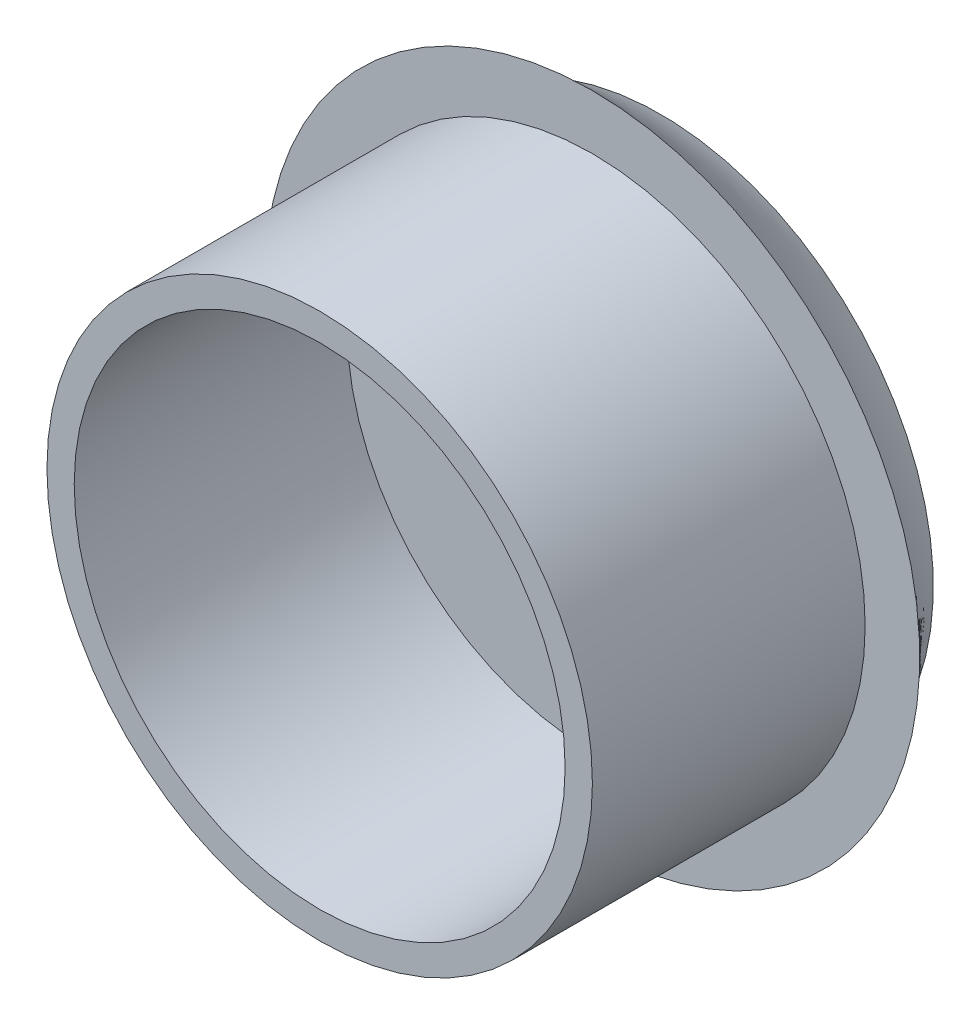
ISO-10303-21;
HEADER;
FILE_DESCRIPTION(('STEP AP214'),'2;1');
FILE_NAME('part.step','',(''),(''),'','','');
FILE_SCHEMA(('AUTOMOTIVE_DESIGN { 1 0 10303 214 1 1 1 1 }'));
ENDSEC;
DATA;
#1=APPLICATION_CONTEXT('core data for automotive mechanical design processes');
#2=APPLICATION_PROTOCOL_DEFINITION('international standard','automotive_design',2000,#1);
#3=PRODUCT_CONTEXT('',#1,'mechanical');
#4=PRODUCT('Part','Part','',(#3));
#5=PRODUCT_RELATED_PRODUCT_CATEGORY('part','',(#4));
#6=PRODUCT_DEFINITION_FORMATION('','',#4);
#7=PRODUCT_DEFINITION_CONTEXT('part definition',#1,'design');
#8=PRODUCT_DEFINITION('design','',#6,#7);
#9=PRODUCT_DEFINITION_SHAPE('','',#8);
#10=(LENGTH_UNIT() NAMED_UNIT(*) SI_UNIT(.MILLI.,.METRE.));
#11=(NAMED_UNIT(*) PLANE_ANGLE_UNIT() SI_UNIT($,.RADIAN.));
#12=(NAMED_UNIT(*) SI_UNIT($,.STERADIAN.) SOLID_ANGLE_UNIT());
#13=UNCERTAINTY_MEASURE_WITH_UNIT(LENGTH_MEASURE(1.E-05),#10,'distance_accuracy_value','');
#14=(GEOMETRIC_REPRESENTATION_CONTEXT(3) GLOBAL_UNCERTAINTY_ASSIGNED_CONTEXT((#13)) GLOBAL_UNIT_ASSIGNED_CONTEXT((#10,
#11,#12)) REPRESENTATION_CONTEXT('',''));
#15=CARTESIAN_POINT('',(0.,0.,0.));
#16=DIRECTION('',(0.,0.,1.));
#17=DIRECTION('',(1.,0.,0.));
#18=AXIS2_PLACEMENT_3D('',#15,#16,#17);
#19=CARTESIAN_POINT('',(0.,0.,10.));
#20=DIRECTION('',(0.,0.,1.));
#21=DIRECTION('',(1.,0.,0.));
#22=AXIS2_PLACEMENT_3D('',#19,#20,#21);
#23=PLANE('',#22);
#24=CARTESIAN_POINT('',(0.,0.,10.));
#25=DIRECTION('',(0.,0.,1.));
#26=DIRECTION('',(1.,0.,0.));
#27=AXIS2_PLACEMENT_3D('',#24,#25,#26);
#28=CIRCLE('',#27,10.);
#29=CARTESIAN_POINT('',(10.,0.,10.));
#30=VERTEX_POINT('',#29);
#31=EDGE_CURVE('E11',#30,#30,#28,.T.);
#32=ORIENTED_EDGE('',*,*,#31,.T.);
#33=EDGE_LOOP('',(#32));
#34=FACE_BOUND('',#33,.T.);
#35=CARTESIAN_POINT('',(0.,0.,10.));
#36=DIRECTION('',(0.,0.,1.));
#37=DIRECTION('',(1.,0.,0.));
#38=AXIS2_PLACEMENT_3D('',#35,#36,#37);
#39=CIRCLE('',#38,9.);
#40=CARTESIAN_POINT('',(9.,0.,10.));
#41=VERTEX_POINT('',#40);
#42=EDGE_CURVE('E43',#41,#41,#39,.T.);
#43=ORIENTED_EDGE('',*,*,#42,.F.);
#44=EDGE_LOOP('',(#43));
#45=FACE_BOUND('',#44,.T.);
#46=ADVANCED_FACE('F35',(#34,#45),#23,.T.);
#47=CARTESIAN_POINT('',(0.,0.,10.));
#48=DIRECTION('',(0.,0.,-1.));
#49=DIRECTION('',(-1.,0.,0.));
#50=AXIS2_PLACEMENT_3D('',#47,#48,#49);
#51=CYLINDRICAL_SURFACE('',#50,10.);
#52=ORIENTED_EDGE('',*,*,#31,.F.);
#53=EDGE_LOOP('',(#52));
#54=FACE_BOUND('',#53,.T.);
#55=CARTESIAN_POINT('',(0.,0.,0.));
#56=DIRECTION('',(0.,0.,1.));
#57=DIRECTION('',(1.,0.,0.));
#58=AXIS2_PLACEMENT_3D('',#55,#56,#57);
#59=CIRCLE('',#58,10.);
#60=CARTESIAN_POINT('',(10.,0.,0.));
#61=VERTEX_POINT('',#60);
#62=EDGE_CURVE('E39',#61,#61,#59,.T.);
#63=ORIENTED_EDGE('',*,*,#62,.T.);
#64=EDGE_LOOP('',(#63));
#65=FACE_BOUND('',#64,.T.);
#66=ADVANCED_FACE('F37',(#54,#65),#51,.T.);
#67=CARTESIAN_POINT('',(0.,0.,10.));
#68=DIRECTION('',(0.,0.,-1.));
#69=DIRECTION('',(-1.,0.,0.));
#70=AXIS2_PLACEMENT_3D('',#67,#68,#69);
#71=CYLINDRICAL_SURFACE('',#70,9.);
#72=ORIENTED_EDGE('',*,*,#42,.T.);
#73=EDGE_LOOP('',(#72));
#74=FACE_BOUND('',#73,.T.);
#75=CARTESIAN_POINT('',(0.,0.,0.));
#76=DIRECTION('',(0.,0.,1.));
#77=DIRECTION('',(1.,0.,0.));
#78=AXIS2_PLACEMENT_3D('',#75,#76,#77);
#79=CIRCLE('',#78,9.);
#80=CARTESIAN_POINT('',(9.,0.,0.));
#81=VERTEX_POINT('',#80);
#82=EDGE_CURVE('E47',#81,#81,#79,.T.);
#83=ORIENTED_EDGE('',*,*,#82,.F.);
#84=EDGE_LOOP('',(#83));
#85=FACE_BOUND('',#84,.T.);
#86=ADVANCED_FACE('F81',(#74,#85),#71,.F.);
#87=CARTESIAN_POINT('',(0.,0.,0.));
#88=DIRECTION('',(0.,0.,-1.));
#89=DIRECTION('',(-1.,0.,0.));
#90=AXIS2_PLACEMENT_3D('',#87,#88,#89);
#91=PLANE('',#90);
#92=ORIENTED_EDGE('',*,*,#82,.T.);
#93=EDGE_LOOP('',(#92));
#94=FACE_BOUND('',#93,.T.);
#95=ADVANCED_FACE('F74',(#94),#91,.F.);
#96=CARTESIAN_POINT('',(0.,0.,-2.5));
#97=DIRECTION('',(0.,0.,-1.));
#98=DIRECTION('',(-1.,0.,0.));
#99=AXIS2_PLACEMENT_3D('',#96,#97,#98);
#100=PLANE('',#99);
#101=CARTESIAN_POINT('',(0.,0.,-2.5));
#102=DIRECTION('',(0.,0.,-1.));
#103=DIRECTION('',(-1.,0.,0.));
#104=AXIS2_PLACEMENT_3D('',#101,#102,#103);
#105=CIRCLE('',#104,10.);
#106=CARTESIAN_POINT('',(-1.50225589120757,9.88651744737914,-2.5));
#107=VERTEX_POINT('',#106);
#108=EDGE_CURVE('E54',#107,#107,#105,.T.);
#109=ORIENTED_EDGE('',*,*,#108,.T.);
#110=EDGE_LOOP('',(#109));
#111=FACE_BOUND('',#110,.T.);
#112=ADVANCED_FACE('F63',(#111),#100,.T.);
#113=ORIENTED_EDGE('',*,*,#62,.F.);
#114=EDGE_LOOP('',(#113));
#115=FACE_BOUND('',#114,.T.);
#116=CARTESIAN_POINT('',(0.,0.,0.));
#117=DIRECTION('',(0.,0.,-1.));
#118=DIRECTION('',(-1.,0.,0.));
#119=AXIS2_PLACEMENT_3D('',#116,#117,#118);
#120=CIRCLE('',#119,12.);
#121=CARTESIAN_POINT('',(2.09285285342094,11.8160893248963,0.));
#122=VERTEX_POINT('',#121);
#123=EDGE_CURVE('E57',#122,#122,#120,.T.);
#124=ORIENTED_EDGE('',*,*,#123,.F.);
#125=EDGE_LOOP('',(#124));
#126=FACE_BOUND('',#125,.T.);
#127=ADVANCED_FACE('F73',(#115,#126),#91,.F.);
#128=CARTESIAN_POINT('',(2.09285285342094,11.8160893248963,0.));
#129=CARTESIAN_POINT('',(-1.50225589120757,9.88651744737914,-2.5));
#130=CARTESIAN_POINT('',(25.7250315032135,7.6303836180544,0.));
#131=CARTESIAN_POINT('',(18.2707790035507,12.8910292297943,-2.5));
#132=CARTESIAN_POINT('',(21.5393257963716,-16.0017950317382,0.));
#133=CARTESIAN_POINT('',(21.2752907859659,-6.88200566496401,-2.5));
#134=CARTESIAN_POINT('',(-2.09285285342094,-11.8160893248963,0.));
#135=CARTESIAN_POINT('',(1.50225589120757,-9.88651744737914,-2.5));
#136=CARTESIAN_POINT('',(-25.7250315032135,-7.6303836180544,0.));
#137=CARTESIAN_POINT('',(-18.2707790035507,-12.8910292297943,-2.5));
#138=CARTESIAN_POINT('',(-21.5393257963716,16.0017950317382,0.));
#139=CARTESIAN_POINT('',(-21.2752907859658,6.88200566496401,-2.5));
#140=CARTESIAN_POINT('',(2.09285285342094,11.8160893248963,0.));
#141=CARTESIAN_POINT('',(-1.50225589120757,9.88651744737914,-2.5));
#142=(BOUNDED_SURFACE() B_SPLINE_SURFACE(3,1,((#128,#129),(#130,#131),(#132,#133),(#134,#135),
(#136,#137),(#138,#139),(#140,#141)),.UNSPECIFIED.,.T.,.F.,.F.) B_SPLINE_SURFACE_WITH_KNOTS((4,
3,4),(2,2),(0.,0.5,1.),(0.,1.),
.UNSPECIFIED.) GEOMETRIC_REPRESENTATION_ITEM() RATIONAL_B_SPLINE_SURFACE(((1.,1.),
(0.333333333333333,0.333333333333333),(0.333333333333333,0.333333333333333),(1.,1.),
(0.333333333333333,0.333333333333333),(0.333333333333333,0.333333333333333),(1.,1.))) REPRESENTATION_ITEM('') SURFACE());
#143=CARTESIAN_POINT('',(2.09285285342094,11.8160893248963,0.));
#144=CARTESIAN_POINT('',(2.05540380399773,11.7959896178388,-0.0260416666666663));
#145=CARTESIAN_POINT('',(2.01795475457451,11.7758899107813,-0.0520833333333331));
#146=CARTESIAN_POINT('',(1.94305665572809,11.7356904966664,-0.104166666666667));
#147=CARTESIAN_POINT('',(1.90560760630487,11.7155907896089,-0.130208333333333));
#148=CARTESIAN_POINT('',(1.83070950745845,11.675391375494,-0.182291666666667));
#149=CARTESIAN_POINT('',(1.79326045803523,11.6552916684365,-0.208333333333333));
#150=CARTESIAN_POINT('',(1.71836235918881,11.6150922543216,-0.260416666666667));
#151=CARTESIAN_POINT('',(1.68091330976559,11.5949925472641,-0.286458333333333));
#152=CARTESIAN_POINT('',(1.60601521091916,11.5547931331492,-0.338541666666667));
#153=CARTESIAN_POINT('',(1.56856616149595,11.5346934260917,-0.364583333333333));
#154=CARTESIAN_POINT('',(1.49366806264952,11.4944940119768,-0.416666666666667));
#155=CARTESIAN_POINT('',(1.45621901322631,11.4743943049193,-0.442708333333333));
#156=CARTESIAN_POINT('',(1.38132091437988,11.4341948908043,-0.494791666666667));
#157=CARTESIAN_POINT('',(1.34387186495667,11.4140951837469,-0.520833333333333));
#158=CARTESIAN_POINT('',(1.26897376611024,11.3738957696319,-0.572916666666667));
#159=CARTESIAN_POINT('',(1.23152471668703,11.3537960625745,-0.598958333333333));
#160=CARTESIAN_POINT('',(1.1566266178406,11.3135966484595,-0.651041666666667));
#161=CARTESIAN_POINT('',(1.11917756841739,11.2934969414021,-0.677083333333333));
#162=CARTESIAN_POINT('',(1.04427946957096,11.2532975272871,-0.729166666666667));
#163=CARTESIAN_POINT('',(1.00683042014775,11.2331978202296,-0.755208333333333));
#164=CARTESIAN_POINT('',(0.931932321301318,11.1929984061147,-0.807291666666667));
#165=CARTESIAN_POINT('',(0.894483271878104,11.1728986990572,-0.833333333333333));
#166=CARTESIAN_POINT('',(0.819585173031677,11.1326992849423,-0.885416666666667));
#167=CARTESIAN_POINT('',(0.782136123608463,11.1125995778848,-0.911458333333333));
#168=CARTESIAN_POINT('',(0.707238024762036,11.0724001637699,-0.963541666666667));
#169=CARTESIAN_POINT('',(0.669788975338822,11.0523004567124,-0.989583333333333));
#170=CARTESIAN_POINT('',(0.594890876492395,11.0121010425975,-1.04166666666667));
#171=CARTESIAN_POINT('',(0.557441827069181,10.99200133554,-1.06770833333333));
#172=CARTESIAN_POINT('',(0.482543728222754,10.9518019214251,-1.11979166666667));
#173=CARTESIAN_POINT('',(0.44509467879954,10.9317022143676,-1.14583333333333));
#174=CARTESIAN_POINT('',(0.370196579953113,10.8915028002527,-1.19791666666667));
#175=CARTESIAN_POINT('',(0.332747530529899,10.8714030931952,-1.22395833333333));
#176=CARTESIAN_POINT('',(0.257849431683472,10.8312036790802,-1.27604166666667));
#177=CARTESIAN_POINT('',(0.220400382260258,10.8111039720228,-1.30208333333333));
#178=CARTESIAN_POINT('',(0.145502283413831,10.7709045579078,-1.35416666666667));
#179=CARTESIAN_POINT('',(0.108053233990617,10.7508048508504,-1.38020833333333));
#180=CARTESIAN_POINT('',(0.03315513514419,10.7106054367354,-1.43229166666667));
#181=CARTESIAN_POINT('',(-0.00429391427902368,10.690505729678,-1.45833333333333));
#182=CARTESIAN_POINT('',(-0.0791920131254511,10.650306315563,-1.51041666666667));
#183=CARTESIAN_POINT('',(-0.116641062548665,10.6302066085055,-1.53645833333333));
#184=CARTESIAN_POINT('',(-0.191539161395092,10.5900071943906,-1.58854166666667));
#185=CARTESIAN_POINT('',(-0.228988210818306,10.5699074873331,-1.61458333333333));
#186=CARTESIAN_POINT('',(-0.303886309664733,10.5297080732182,-1.66666666666667));
#187=CARTESIAN_POINT('',(-0.341335359087947,10.5096083661607,-1.69270833333333));
#188=CARTESIAN_POINT('',(-0.416233457934374,10.4694089520458,-1.74479166666667));
#189=CARTESIAN_POINT('',(-0.453682507357588,10.4493092449883,-1.77083333333333));
#190=CARTESIAN_POINT('',(-0.528580606204015,10.4091098308734,-1.82291666666667));
#191=CARTESIAN_POINT('',(-0.566029655627229,10.3890101238159,-1.84895833333333));
#192=CARTESIAN_POINT('',(-0.640927754473656,10.348810709701,-1.90104166666667));
#193=CARTESIAN_POINT('',(-0.67837680389687,10.3287110026435,-1.92708333333333));
#194=CARTESIAN_POINT('',(-0.753274902743297,10.2885115885285,-1.97916666666667));
#195=CARTESIAN_POINT('',(-0.790723952166511,10.2684118814711,-2.00520833333333));
#196=CARTESIAN_POINT('',(-0.865622051012938,10.2282124673561,-2.05729166666667));
#197=CARTESIAN_POINT('',(-0.903071100436152,10.2081127602987,-2.08333333333333));
#198=CARTESIAN_POINT('',(-0.977969199282579,10.1679133461837,-2.13541666666667));
#199=CARTESIAN_POINT('',(-1.01541824870579,10.1478136391263,-2.16145833333333));
#200=CARTESIAN_POINT('',(-1.09031634755222,10.1076142250113,-2.21354166666667));
#201=CARTESIAN_POINT('',(-1.12776539697543,10.0875145179538,-2.23958333333333));
#202=CARTESIAN_POINT('',(-1.20266349582186,10.0473151038389,-2.29166666666667));
#203=CARTESIAN_POINT('',(-1.24011254524507,10.0272153967814,-2.31770833333333));
#204=CARTESIAN_POINT('',(-1.3150106440915,9.98701598266649,-2.36979166666667));
#205=CARTESIAN_POINT('',(-1.35245969351472,9.96691627560902,-2.39583333333333));
#206=CARTESIAN_POINT('',(-1.42735779236114,9.92671686149408,-2.44791666666667));
#207=CARTESIAN_POINT('',(-1.46480684178436,9.90661715443661,-2.47395833333333));
#208=CARTESIAN_POINT('',(-1.50225589120757,9.88651744737914,-2.5));
#209=B_SPLINE_CURVE_WITH_KNOTS('',3,(#143,#144,#145,#146,#147,#148,#149,#150,#151,#152,#153,
#154,#155,#156,#157,#158,#159,#160,#161,#162,#163,#164,#165,#166,#167,#168,#169,#170,#171,#172,
#173,#174,#175,#176,#177,#178,#179,#180,#181,#182,#183,#184,#185,#186,#187,#188,#189,#190,#191,
#192,#193,#194,#195,#196,#197,#198,#199,#200,#201,#202,#203,#204,#205,#206,#207,#208),
.UNSPECIFIED.,.F.,.F.,(4,2,2,2,2,2,2,2,2,2,2,2,2,2,2,2,2,2,2,2,2,2,2,2,2,2,2,2,2,2,2,2,4),(0.,
0.149537224006218,0.299074448012436,0.448611672018654,0.598148896024871,0.747686120031089,
0.897223344037306,1.04676056804353,1.19629779204974,1.34583501605596,1.49537224006218,
1.6449094640684,1.79444668807461,1.94398391208083,2.09352113608705,2.24305836009327,
2.39259558409948,2.5421328081057,2.69167003211192,2.84120725611814,2.99074448012436,
3.14028170413057,3.28981892813679,3.43935615214301,3.58889337614923,3.73843060015545,
3.88796782416166,4.03750504816788,4.1870422721741,4.33657949618032,4.48611672018654,
4.63565394419275,4.78519116819897),.UNSPECIFIED.);
#210=EDGE_CURVE('BSEAM76',#122,#107,#209,.T.);
#211=ORIENTED_EDGE('',*,*,#123,.T.);
#212=ORIENTED_EDGE('',*,*,#108,.F.);
#213=ORIENTED_EDGE('',*,*,#210,.T.);
#214=ORIENTED_EDGE('',*,*,#210,.F.);
#215=EDGE_LOOP('',(#211,#213,#212,#214));
#216=FACE_BOUND('',#215,.T.);
#217=ADVANCED_FACE('F76',(#216),#142,.T.);
#218=CLOSED_SHELL('',(#46,#66,#86,#95,#112,#127,#217));
#219=MANIFOLD_SOLID_BREP('B2',#218);
#220=ADVANCED_BREP_SHAPE_REPRESENTATION('',(#18,#219),#14);
#221=SHAPE_DEFINITION_REPRESENTATION(#9,#220);
ENDSEC;
END-ISO-10303-21;
